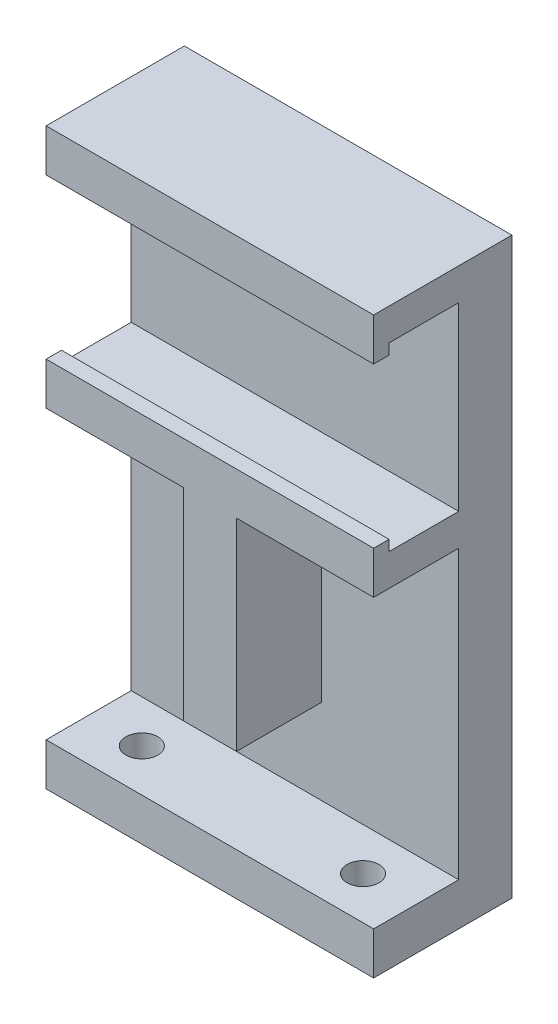
ISO-10303-21;
HEADER;
FILE_DESCRIPTION(('STEP AP214'),'2;1');
FILE_NAME('part.step','',(''),(''),'','','');
FILE_SCHEMA(('AUTOMOTIVE_DESIGN { 1 0 10303 214 1 1 1 1 }'));
ENDSEC;
DATA;
#1=APPLICATION_CONTEXT('core data for automotive mechanical design processes');
#2=APPLICATION_PROTOCOL_DEFINITION('international standard','automotive_design',2000,#1);
#3=PRODUCT_CONTEXT('',#1,'mechanical');
#4=PRODUCT('Part','Part','',(#3));
#5=PRODUCT_RELATED_PRODUCT_CATEGORY('part','',(#4));
#6=PRODUCT_DEFINITION_FORMATION('','',#4);
#7=PRODUCT_DEFINITION_CONTEXT('part definition',#1,'design');
#8=PRODUCT_DEFINITION('design','',#6,#7);
#9=PRODUCT_DEFINITION_SHAPE('','',#8);
#10=(LENGTH_UNIT() NAMED_UNIT(*) SI_UNIT(.MILLI.,.METRE.));
#11=(NAMED_UNIT(*) PLANE_ANGLE_UNIT() SI_UNIT($,.RADIAN.));
#12=(NAMED_UNIT(*) SI_UNIT($,.STERADIAN.) SOLID_ANGLE_UNIT());
#13=UNCERTAINTY_MEASURE_WITH_UNIT(LENGTH_MEASURE(1.E-05),#10,'distance_accuracy_value','');
#14=(GEOMETRIC_REPRESENTATION_CONTEXT(3) GLOBAL_UNCERTAINTY_ASSIGNED_CONTEXT((#13)) GLOBAL_UNIT_ASSIGNED_CONTEXT((#10,
#11,#12)) REPRESENTATION_CONTEXT('',''));
#15=CARTESIAN_POINT('',(0.,0.,0.));
#16=DIRECTION('',(0.,0.,1.));
#17=DIRECTION('',(1.,0.,0.));
#18=AXIS2_PLACEMENT_3D('',#15,#16,#17);
#19=CARTESIAN_POINT('',(0.,42.,5.));
#20=DIRECTION('',(0.,0.,-1.));
#21=DIRECTION('',(-1.,0.,0.));
#22=AXIS2_PLACEMENT_3D('',#19,#20,#21);
#23=PLANE('',#22);
#24=DIRECTION('',(0.,1.,0.));
#25=VECTOR('',#24,1.);
#26=CARTESIAN_POINT('',(17.9,0.,5.));
#27=LINE('',#26,#25);
#28=CARTESIAN_POINT('',(17.9,0.,5.));
#29=VERTEX_POINT('',#28);
#30=CARTESIAN_POINT('',(17.9,19.,5.));
#31=VERTEX_POINT('',#30);
#32=EDGE_CURVE('E307',#29,#31,#27,.T.);
#33=ORIENTED_EDGE('',*,*,#32,.F.);
#34=DIRECTION('',(1.,0.,0.));
#35=VECTOR('',#34,1.);
#36=CARTESIAN_POINT('',(-17.6918060129541,0.,5.));
#37=LINE('',#36,#35);
#38=CARTESIAN_POINT('',(12.9,0.,5.));
#39=VERTEX_POINT('',#38);
#40=EDGE_CURVE('E11',#39,#29,#37,.T.);
#41=ORIENTED_EDGE('',*,*,#40,.F.);
#42=DIRECTION('',(0.,-1.,0.));
#43=VECTOR('',#42,1.);
#44=CARTESIAN_POINT('',(12.9,0.,5.));
#45=LINE('',#44,#43);
#46=CARTESIAN_POINT('',(12.9,19.,5.));
#47=VERTEX_POINT('',#46);
#48=EDGE_CURVE('E285',#47,#39,#45,.T.);
#49=ORIENTED_EDGE('',*,*,#48,.F.);
#50=DIRECTION('',(1.,0.,0.));
#51=VECTOR('',#50,1.);
#52=CARTESIAN_POINT('',(0.,19.,5.));
#53=LINE('',#52,#51);
#54=CARTESIAN_POINT('',(0.,19.,5.));
#55=VERTEX_POINT('',#54);
#56=EDGE_CURVE('E60',#55,#47,#53,.T.);
#57=ORIENTED_EDGE('',*,*,#56,.F.);
#58=DIRECTION('',(0.,-1.,0.));
#59=VECTOR('',#58,1.);
#60=CARTESIAN_POINT('',(0.,0.,5.));
#61=LINE('',#60,#59);
#62=CARTESIAN_POINT('',(0.,-8.,5.));
#63=VERTEX_POINT('',#62);
#64=EDGE_CURVE('E381',#55,#63,#61,.T.);
#65=ORIENTED_EDGE('',*,*,#64,.T.);
#66=DIRECTION('',(1.,0.,0.));
#67=VECTOR('',#66,1.);
#68=CARTESIAN_POINT('',(-17.6918060129541,-8.,5.));
#69=LINE('',#68,#67);
#70=CARTESIAN_POINT('',(30.8,-8.,5.));
#71=VERTEX_POINT('',#70);
#72=EDGE_CURVE('E294',#63,#71,#69,.T.);
#73=ORIENTED_EDGE('',*,*,#72,.T.);
#74=DIRECTION('',(0.,1.,0.));
#75=VECTOR('',#74,1.);
#76=CARTESIAN_POINT('',(30.8,0.,5.));
#77=LINE('',#76,#75);
#78=CARTESIAN_POINT('',(30.8,19.,5.));
#79=VERTEX_POINT('',#78);
#80=EDGE_CURVE('E357',#71,#79,#77,.T.);
#81=ORIENTED_EDGE('',*,*,#80,.T.);
#82=EDGE_CURVE('E326',#31,#79,#53,.T.);
#83=ORIENTED_EDGE('',*,*,#82,.F.);
#84=EDGE_LOOP('',(#33,#41,#49,#57,#65,#73,#81,#83));
#85=FACE_BOUND('',#84,.T.);
#86=ADVANCED_FACE('F34',(#85),#23,.F.);
#87=CARTESIAN_POINT('',(0.,19.,13.));
#88=DIRECTION('',(0.,1.,0.));
#89=DIRECTION('',(0.,0.,1.));
#90=AXIS2_PLACEMENT_3D('',#87,#88,#89);
#91=PLANE('',#90);
#92=DIRECTION('',(0.,0.,-1.));
#93=VECTOR('',#92,1.);
#94=CARTESIAN_POINT('',(12.9,19.,13.));
#95=LINE('',#94,#93);
#96=CARTESIAN_POINT('',(12.9,19.,13.));
#97=VERTEX_POINT('',#96);
#98=EDGE_CURVE('E311',#97,#47,#95,.T.);
#99=ORIENTED_EDGE('',*,*,#98,.F.);
#100=DIRECTION('',(1.,0.,0.));
#101=VECTOR('',#100,1.);
#102=CARTESIAN_POINT('',(0.,19.,13.));
#103=LINE('',#102,#101);
#104=CARTESIAN_POINT('',(0.,19.,13.));
#105=VERTEX_POINT('',#104);
#106=EDGE_CURVE('E319',#105,#97,#103,.T.);
#107=ORIENTED_EDGE('',*,*,#106,.F.);
#108=DIRECTION('',(0.,0.,-1.));
#109=VECTOR('',#108,1.);
#110=CARTESIAN_POINT('',(0.,19.,13.));
#111=LINE('',#110,#109);
#112=EDGE_CURVE('E335',#105,#55,#111,.T.);
#113=ORIENTED_EDGE('',*,*,#112,.T.);
#114=ORIENTED_EDGE('',*,*,#56,.T.);
#115=EDGE_LOOP('',(#99,#107,#113,#114));
#116=FACE_BOUND('',#115,.T.);
#117=ADVANCED_FACE('F464',(#116),#91,.F.);
#118=DIRECTION('',(0.,0.,-1.));
#119=VECTOR('',#118,1.);
#120=CARTESIAN_POINT('',(17.9,19.,13.));
#121=LINE('',#120,#119);
#122=CARTESIAN_POINT('',(17.9,19.,13.));
#123=VERTEX_POINT('',#122);
#124=EDGE_CURVE('E52',#123,#31,#121,.T.);
#125=ORIENTED_EDGE('',*,*,#124,.T.);
#126=ORIENTED_EDGE('',*,*,#82,.T.);
#127=DIRECTION('',(0.,0.,-1.));
#128=VECTOR('',#127,1.);
#129=CARTESIAN_POINT('',(30.8,19.,13.));
#130=LINE('',#129,#128);
#131=CARTESIAN_POINT('',(30.8,19.,13.));
#132=VERTEX_POINT('',#131);
#133=EDGE_CURVE('E332',#132,#79,#130,.T.);
#134=ORIENTED_EDGE('',*,*,#133,.F.);
#135=EDGE_CURVE('E317',#123,#132,#103,.T.);
#136=ORIENTED_EDGE('',*,*,#135,.F.);
#137=EDGE_LOOP('',(#125,#126,#134,#136));
#138=FACE_BOUND('',#137,.T.);
#139=ADVANCED_FACE('F475',(#138),#91,.F.);
#140=DIRECTION('',(-1.,0.,0.));
#141=VECTOR('',#140,1.);
#142=CARTESIAN_POINT('',(0.,22.,5.));
#143=LINE('',#142,#141);
#144=CARTESIAN_POINT('',(30.8,22.,5.));
#145=VERTEX_POINT('',#144);
#146=CARTESIAN_POINT('',(0.,22.,5.));
#147=VERTEX_POINT('',#146);
#148=EDGE_CURVE('E318',#145,#147,#143,.T.);
#149=ORIENTED_EDGE('',*,*,#148,.F.);
#150=CARTESIAN_POINT('',(30.8,39.,5.));
#151=VERTEX_POINT('',#150);
#152=EDGE_CURVE('E385',#145,#151,#77,.T.);
#153=ORIENTED_EDGE('',*,*,#152,.T.);
#154=DIRECTION('',(1.,0.,0.));
#155=VECTOR('',#154,1.);
#156=CARTESIAN_POINT('',(0.,39.,5.));
#157=LINE('',#156,#155);
#158=CARTESIAN_POINT('',(0.,39.,5.));
#159=VERTEX_POINT('',#158);
#160=EDGE_CURVE('E338',#159,#151,#157,.T.);
#161=ORIENTED_EDGE('',*,*,#160,.F.);
#162=EDGE_CURVE('E383',#159,#147,#61,.T.);
#163=ORIENTED_EDGE('',*,*,#162,.T.);
#164=EDGE_LOOP('',(#149,#153,#161,#163));
#165=FACE_BOUND('',#164,.T.);
#166=ADVANCED_FACE('F405',(#165),#23,.F.);
#167=CARTESIAN_POINT('',(0.,0.,5.));
#168=DIRECTION('',(1.,0.,0.));
#169=DIRECTION('',(0.,0.,-1.));
#170=AXIS2_PLACEMENT_3D('',#167,#168,#169);
#171=PLANE('',#170);
#172=DIRECTION('',(0.,-1.,0.));
#173=VECTOR('',#172,1.);
#174=CARTESIAN_POINT('',(0.,0.,0.));
#175=LINE('',#174,#173);
#176=CARTESIAN_POINT('',(0.,42.,0.));
#177=VERTEX_POINT('',#176);
#178=CARTESIAN_POINT('',(0.,-12.,0.));
#179=VERTEX_POINT('',#178);
#180=EDGE_CURVE('E390',#177,#179,#175,.T.);
#181=ORIENTED_EDGE('',*,*,#180,.T.);
#182=DIRECTION('',(0.,0.,1.));
#183=VECTOR('',#182,1.);
#184=CARTESIAN_POINT('',(0.,-12.,13.));
#185=LINE('',#184,#183);
#186=CARTESIAN_POINT('',(0.,-12.,13.));
#187=VERTEX_POINT('',#186);
#188=EDGE_CURVE('E283',#179,#187,#185,.T.);
#189=ORIENTED_EDGE('',*,*,#188,.T.);
#190=DIRECTION('',(0.,1.,0.));
#191=VECTOR('',#190,1.);
#192=CARTESIAN_POINT('',(0.,-8.,13.));
#193=LINE('',#192,#191);
#194=CARTESIAN_POINT('',(0.,-8.,13.));
#195=VERTEX_POINT('',#194);
#196=EDGE_CURVE('E280',#187,#195,#193,.T.);
#197=ORIENTED_EDGE('',*,*,#196,.T.);
#198=DIRECTION('',(0.,0.,-1.));
#199=VECTOR('',#198,1.);
#200=CARTESIAN_POINT('',(0.,-8.,5.));
#201=LINE('',#200,#199);
#202=EDGE_CURVE('E277',#195,#63,#201,.T.);
#203=ORIENTED_EDGE('',*,*,#202,.T.);
#204=ORIENTED_EDGE('',*,*,#64,.F.);
#205=ORIENTED_EDGE('',*,*,#112,.F.);
#206=DIRECTION('',(0.,-1.,0.));
#207=VECTOR('',#206,1.);
#208=CARTESIAN_POINT('',(0.,22.,13.));
#209=LINE('',#208,#207);
#210=CARTESIAN_POINT('',(0.,22.,13.));
#211=VERTEX_POINT('',#210);
#212=EDGE_CURVE('E315',#211,#105,#209,.T.);
#213=ORIENTED_EDGE('',*,*,#212,.F.);
#214=DIRECTION('',(0.,0.,-1.));
#215=VECTOR('',#214,1.);
#216=CARTESIAN_POINT('',(0.,22.,13.));
#217=LINE('',#216,#215);
#218=CARTESIAN_POINT('',(0.,22.,11.55));
#219=VERTEX_POINT('',#218);
#220=EDGE_CURVE('E199',#211,#219,#217,.T.);
#221=ORIENTED_EDGE('',*,*,#220,.T.);
#222=EDGE_CURVE('E324',#219,#147,#217,.T.);
#223=ORIENTED_EDGE('',*,*,#222,.T.);
#224=ORIENTED_EDGE('',*,*,#162,.F.);
#225=DIRECTION('',(0.,0.,-1.));
#226=VECTOR('',#225,1.);
#227=CARTESIAN_POINT('',(0.,39.,13.));
#228=LINE('',#227,#226);
#229=CARTESIAN_POINT('',(0.,39.,11.55));
#230=VERTEX_POINT('',#229);
#231=EDGE_CURVE('E38',#230,#159,#228,.T.);
#232=ORIENTED_EDGE('',*,*,#231,.F.);
#233=CARTESIAN_POINT('',(0.,39.,13.));
#234=VERTEX_POINT('',#233);
#235=EDGE_CURVE('E361',#234,#230,#228,.T.);
#236=ORIENTED_EDGE('',*,*,#235,.F.);
#237=DIRECTION('',(0.,-1.,0.));
#238=VECTOR('',#237,1.);
#239=CARTESIAN_POINT('',(0.,39.,13.));
#240=LINE('',#239,#238);
#241=CARTESIAN_POINT('',(0.,42.,13.));
#242=VERTEX_POINT('',#241);
#243=EDGE_CURVE('E345',#242,#234,#240,.T.);
#244=ORIENTED_EDGE('',*,*,#243,.F.);
#245=DIRECTION('',(0.,0.,-1.));
#246=VECTOR('',#245,1.);
#247=CARTESIAN_POINT('',(0.,42.,5.));
#248=LINE('',#247,#246);
#249=EDGE_CURVE('E396',#242,#177,#248,.T.);
#250=ORIENTED_EDGE('',*,*,#249,.T.);
#251=EDGE_LOOP('',(#181,#189,#197,#203,#204,#205,#213,#221,#223,#224,#232,#236,#244,#250));
#252=FACE_BOUND('',#251,.T.);
#253=ADVANCED_FACE('F36',(#252),#171,.F.);
#254=CARTESIAN_POINT('',(0.,0.,5.));
#255=DIRECTION('',(0.,1.,0.));
#256=DIRECTION('',(0.,0.,1.));
#257=AXIS2_PLACEMENT_3D('',#254,#255,#256);
#258=PLANE('',#257);
#259=DIRECTION('',(0.,0.,-1.));
#260=VECTOR('',#259,1.);
#261=CARTESIAN_POINT('',(12.9,0.,13.));
#262=LINE('',#261,#260);
#263=CARTESIAN_POINT('',(12.9,0.,13.));
#264=VERTEX_POINT('',#263);
#265=EDGE_CURVE('E369',#264,#39,#262,.T.);
#266=ORIENTED_EDGE('',*,*,#265,.T.);
#267=ORIENTED_EDGE('',*,*,#40,.T.);
#268=DIRECTION('',(0.,0.,-1.));
#269=VECTOR('',#268,1.);
#270=CARTESIAN_POINT('',(17.9,0.,13.));
#271=LINE('',#270,#269);
#272=CARTESIAN_POINT('',(17.9,0.,13.));
#273=VERTEX_POINT('',#272);
#274=EDGE_CURVE('E314',#273,#29,#271,.T.);
#275=ORIENTED_EDGE('',*,*,#274,.F.);
#276=DIRECTION('',(1.,0.,0.));
#277=VECTOR('',#276,1.);
#278=CARTESIAN_POINT('',(12.9,0.,13.));
#279=LINE('',#278,#277);
#280=EDGE_CURVE('E306',#264,#273,#279,.T.);
#281=ORIENTED_EDGE('',*,*,#280,.F.);
#282=EDGE_LOOP('',(#266,#267,#275,#281));
#283=FACE_BOUND('',#282,.T.);
#284=ADVANCED_FACE('F470',(#283),#258,.F.);
#285=CARTESIAN_POINT('',(30.8,0.,5.));
#286=DIRECTION('',(-1.,0.,0.));
#287=DIRECTION('',(0.,0.,1.));
#288=AXIS2_PLACEMENT_3D('',#285,#286,#287);
#289=PLANE('',#288);
#290=DIRECTION('',(0.,1.,0.));
#291=VECTOR('',#290,1.);
#292=CARTESIAN_POINT('',(30.8,0.,0.));
#293=LINE('',#292,#291);
#294=CARTESIAN_POINT('',(30.8,-12.,0.));
#295=VERTEX_POINT('',#294);
#296=CARTESIAN_POINT('',(30.8,42.,0.));
#297=VERTEX_POINT('',#296);
#298=EDGE_CURVE('E393',#295,#297,#293,.T.);
#299=ORIENTED_EDGE('',*,*,#298,.T.);
#300=DIRECTION('',(0.,0.,-1.));
#301=VECTOR('',#300,1.);
#302=CARTESIAN_POINT('',(30.8,42.,5.));
#303=LINE('',#302,#301);
#304=CARTESIAN_POINT('',(30.8,42.,13.));
#305=VERTEX_POINT('',#304);
#306=EDGE_CURVE('E44',#305,#297,#303,.T.);
#307=ORIENTED_EDGE('',*,*,#306,.F.);
#308=DIRECTION('',(0.,1.,0.));
#309=VECTOR('',#308,1.);
#310=CARTESIAN_POINT('',(30.8,42.,13.));
#311=LINE('',#310,#309);
#312=CARTESIAN_POINT('',(30.8,38.,13.));
#313=VERTEX_POINT('',#312);
#314=EDGE_CURVE('E339',#313,#305,#311,.T.);
#315=ORIENTED_EDGE('',*,*,#314,.F.);
#316=DIRECTION('',(0.,0.,-1.));
#317=VECTOR('',#316,1.);
#318=CARTESIAN_POINT('',(30.8,38.,13.));
#319=LINE('',#318,#317);
#320=CARTESIAN_POINT('',(30.8,38.,11.55));
#321=VERTEX_POINT('',#320);
#322=EDGE_CURVE('E231',#313,#321,#319,.T.);
#323=ORIENTED_EDGE('',*,*,#322,.T.);
#324=DIRECTION('',(0.,1.,0.));
#325=VECTOR('',#324,1.);
#326=CARTESIAN_POINT('',(30.8,39.,11.55));
#327=LINE('',#326,#325);
#328=CARTESIAN_POINT('',(30.8,39.,11.55));
#329=VERTEX_POINT('',#328);
#330=EDGE_CURVE('E240',#321,#329,#327,.T.);
#331=ORIENTED_EDGE('',*,*,#330,.T.);
#332=DIRECTION('',(0.,0.,-1.));
#333=VECTOR('',#332,1.);
#334=CARTESIAN_POINT('',(30.8,39.,13.));
#335=LINE('',#334,#333);
#336=EDGE_CURVE('E348',#329,#151,#335,.T.);
#337=ORIENTED_EDGE('',*,*,#336,.T.);
#338=ORIENTED_EDGE('',*,*,#152,.F.);
#339=DIRECTION('',(0.,0.,-1.));
#340=VECTOR('',#339,1.);
#341=CARTESIAN_POINT('',(30.8,22.,13.));
#342=LINE('',#341,#340);
#343=CARTESIAN_POINT('',(30.8,22.,11.55));
#344=VERTEX_POINT('',#343);
#345=EDGE_CURVE('E330',#344,#145,#342,.T.);
#346=ORIENTED_EDGE('',*,*,#345,.F.);
#347=DIRECTION('',(0.,1.,0.));
#348=VECTOR('',#347,1.);
#349=CARTESIAN_POINT('',(30.8,22.,11.55));
#350=LINE('',#349,#348);
#351=CARTESIAN_POINT('',(30.8,23.,11.55));
#352=VERTEX_POINT('',#351);
#353=EDGE_CURVE('E223',#344,#352,#350,.T.);
#354=ORIENTED_EDGE('',*,*,#353,.T.);
#355=DIRECTION('',(0.,0.,1.));
#356=VECTOR('',#355,1.);
#357=CARTESIAN_POINT('',(30.8,23.,13.));
#358=LINE('',#357,#356);
#359=CARTESIAN_POINT('',(30.8,23.,13.));
#360=VERTEX_POINT('',#359);
#361=EDGE_CURVE('E220',#352,#360,#358,.T.);
#362=ORIENTED_EDGE('',*,*,#361,.T.);
#363=DIRECTION('',(0.,1.,0.));
#364=VECTOR('',#363,1.);
#365=CARTESIAN_POINT('',(30.8,22.,13.));
#366=LINE('',#365,#364);
#367=EDGE_CURVE('E322',#132,#360,#366,.T.);
#368=ORIENTED_EDGE('',*,*,#367,.F.);
#369=ORIENTED_EDGE('',*,*,#133,.T.);
#370=ORIENTED_EDGE('',*,*,#80,.F.);
#371=DIRECTION('',(0.,0.,1.));
#372=VECTOR('',#371,1.);
#373=CARTESIAN_POINT('',(30.8,-8.,5.));
#374=LINE('',#373,#372);
#375=CARTESIAN_POINT('',(30.8,-8.,13.));
#376=VERTEX_POINT('',#375);
#377=EDGE_CURVE('E274',#71,#376,#374,.T.);
#378=ORIENTED_EDGE('',*,*,#377,.T.);
#379=DIRECTION('',(0.,-1.,0.));
#380=VECTOR('',#379,1.);
#381=CARTESIAN_POINT('',(30.8,-8.,13.));
#382=LINE('',#381,#380);
#383=CARTESIAN_POINT('',(30.8,-12.,13.));
#384=VERTEX_POINT('',#383);
#385=EDGE_CURVE('E288',#376,#384,#382,.T.);
#386=ORIENTED_EDGE('',*,*,#385,.T.);
#387=DIRECTION('',(0.,0.,-1.));
#388=VECTOR('',#387,1.);
#389=CARTESIAN_POINT('',(30.8,-12.,13.));
#390=LINE('',#389,#388);
#391=EDGE_CURVE('E291',#384,#295,#390,.T.);
#392=ORIENTED_EDGE('',*,*,#391,.T.);
#393=EDGE_LOOP('',(#299,#307,#315,#323,#331,#337,#338,#346,#354,#362,#368,#369,#370,#378,#386,#392));
#394=FACE_BOUND('',#393,.T.);
#395=ADVANCED_FACE('F415',(#394),#289,.F.);
#396=CARTESIAN_POINT('',(0.,42.,5.));
#397=DIRECTION('',(0.,-1.,0.));
#398=DIRECTION('',(0.,0.,-1.));
#399=AXIS2_PLACEMENT_3D('',#396,#397,#398);
#400=PLANE('',#399);
#401=DIRECTION('',(-1.,0.,0.));
#402=VECTOR('',#401,1.);
#403=CARTESIAN_POINT('',(0.,42.,0.));
#404=LINE('',#403,#402);
#405=EDGE_CURVE('E384',#297,#177,#404,.T.);
#406=ORIENTED_EDGE('',*,*,#405,.T.);
#407=ORIENTED_EDGE('',*,*,#249,.F.);
#408=DIRECTION('',(-1.,0.,0.));
#409=VECTOR('',#408,1.);
#410=CARTESIAN_POINT('',(0.,42.,13.));
#411=LINE('',#410,#409);
#412=EDGE_CURVE('E342',#305,#242,#411,.T.);
#413=ORIENTED_EDGE('',*,*,#412,.F.);
#414=ORIENTED_EDGE('',*,*,#306,.T.);
#415=EDGE_LOOP('',(#406,#407,#413,#414));
#416=FACE_BOUND('',#415,.T.);
#417=ADVANCED_FACE('F514',(#416),#400,.F.);
#418=CARTESIAN_POINT('',(0.,42.,0.));
#419=DIRECTION('',(0.,0.,-1.));
#420=DIRECTION('',(-1.,0.,0.));
#421=AXIS2_PLACEMENT_3D('',#418,#419,#420);
#422=PLANE('',#421);
#423=ORIENTED_EDGE('',*,*,#180,.F.);
#424=ORIENTED_EDGE('',*,*,#405,.F.);
#425=ORIENTED_EDGE('',*,*,#298,.F.);
#426=DIRECTION('',(1.,0.,0.));
#427=VECTOR('',#426,1.);
#428=CARTESIAN_POINT('',(-17.6918060129541,-12.,0.));
#429=LINE('',#428,#427);
#430=EDGE_CURVE('E281',#179,#295,#429,.T.);
#431=ORIENTED_EDGE('',*,*,#430,.F.);
#432=EDGE_LOOP('',(#423,#424,#425,#431));
#433=FACE_BOUND('',#432,.T.);
#434=ADVANCED_FACE('F443',(#433),#422,.T.);
#435=CARTESIAN_POINT('',(0.,39.,13.));
#436=DIRECTION('',(0.,1.,0.));
#437=DIRECTION('',(0.,0.,1.));
#438=AXIS2_PLACEMENT_3D('',#435,#436,#437);
#439=PLANE('',#438);
#440=ORIENTED_EDGE('',*,*,#336,.F.);
#441=DIRECTION('',(1.,0.,0.));
#442=VECTOR('',#441,1.);
#443=CARTESIAN_POINT('',(-5.00000000014378E-05,39.,11.55));
#444=LINE('',#443,#442);
#445=EDGE_CURVE('E260',#230,#329,#444,.T.);
#446=ORIENTED_EDGE('',*,*,#445,.F.);
#447=ORIENTED_EDGE('',*,*,#231,.T.);
#448=ORIENTED_EDGE('',*,*,#160,.T.);
#449=EDGE_LOOP('',(#440,#446,#447,#448));
#450=FACE_BOUND('',#449,.T.);
#451=ADVANCED_FACE('F418',(#450),#439,.F.);
#452=CARTESIAN_POINT('',(30.8,39.,13.));
#453=DIRECTION('',(0.,0.,1.));
#454=DIRECTION('',(1.,0.,0.));
#455=AXIS2_PLACEMENT_3D('',#452,#453,#454);
#456=PLANE('',#455);
#457=ORIENTED_EDGE('',*,*,#314,.T.);
#458=ORIENTED_EDGE('',*,*,#412,.T.);
#459=ORIENTED_EDGE('',*,*,#243,.T.);
#460=DIRECTION('',(1.,0.,0.));
#461=VECTOR('',#460,1.);
#462=CARTESIAN_POINT('',(-5.00000000014378E-05,39.,13.));
#463=LINE('',#462,#461);
#464=CARTESIAN_POINT('',(-5.00000000014378E-05,39.,13.));
#465=VERTEX_POINT('',#464);
#466=EDGE_CURVE('E254',#465,#234,#463,.T.);
#467=ORIENTED_EDGE('',*,*,#466,.F.);
#468=DIRECTION('',(0.,-1.,0.));
#469=VECTOR('',#468,1.);
#470=CARTESIAN_POINT('',(-5.00000000014378E-05,39.,13.));
#471=LINE('',#470,#469);
#472=CARTESIAN_POINT('',(-5.00000000014378E-05,38.,13.));
#473=VERTEX_POINT('',#472);
#474=EDGE_CURVE('E236',#465,#473,#471,.T.);
#475=ORIENTED_EDGE('',*,*,#474,.T.);
#476=DIRECTION('',(1.,0.,0.));
#477=VECTOR('',#476,1.);
#478=CARTESIAN_POINT('',(-5.00000000014378E-05,38.,13.));
#479=LINE('',#478,#477);
#480=EDGE_CURVE('E249',#473,#313,#479,.T.);
#481=ORIENTED_EDGE('',*,*,#480,.T.);
#482=EDGE_LOOP('',(#457,#458,#459,#467,#475,#481));
#483=FACE_BOUND('',#482,.T.);
#484=ADVANCED_FACE('F434',(#483),#456,.T.);
#485=CARTESIAN_POINT('',(0.,22.,13.));
#486=DIRECTION('',(0.,-1.,0.));
#487=DIRECTION('',(0.,0.,-1.));
#488=AXIS2_PLACEMENT_3D('',#485,#486,#487);
#489=PLANE('',#488);
#490=ORIENTED_EDGE('',*,*,#222,.F.);
#491=DIRECTION('',(1.,0.,0.));
#492=VECTOR('',#491,1.);
#493=CARTESIAN_POINT('',(-5.00000000014378E-05,22.,11.55));
#494=LINE('',#493,#492);
#495=EDGE_CURVE('E204',#219,#344,#494,.T.);
#496=ORIENTED_EDGE('',*,*,#495,.T.);
#497=ORIENTED_EDGE('',*,*,#345,.T.);
#498=ORIENTED_EDGE('',*,*,#148,.T.);
#499=EDGE_LOOP('',(#490,#496,#497,#498));
#500=FACE_BOUND('',#499,.T.);
#501=ADVANCED_FACE('F410',(#500),#489,.F.);
#502=CARTESIAN_POINT('',(0.,19.,13.));
#503=DIRECTION('',(0.,0.,1.));
#504=DIRECTION('',(1.,0.,0.));
#505=AXIS2_PLACEMENT_3D('',#502,#503,#504);
#506=PLANE('',#505);
#507=ORIENTED_EDGE('',*,*,#212,.T.);
#508=ORIENTED_EDGE('',*,*,#106,.T.);
#509=DIRECTION('',(0.,-1.,0.));
#510=VECTOR('',#509,1.);
#511=CARTESIAN_POINT('',(12.9,0.,13.));
#512=LINE('',#511,#510);
#513=EDGE_CURVE('E303',#97,#264,#512,.T.);
#514=ORIENTED_EDGE('',*,*,#513,.T.);
#515=ORIENTED_EDGE('',*,*,#280,.T.);
#516=DIRECTION('',(0.,1.,0.));
#517=VECTOR('',#516,1.);
#518=CARTESIAN_POINT('',(17.9,0.,13.));
#519=LINE('',#518,#517);
#520=EDGE_CURVE('E309',#273,#123,#519,.T.);
#521=ORIENTED_EDGE('',*,*,#520,.T.);
#522=ORIENTED_EDGE('',*,*,#135,.T.);
#523=ORIENTED_EDGE('',*,*,#367,.T.);
#524=DIRECTION('',(1.,0.,0.));
#525=VECTOR('',#524,1.);
#526=CARTESIAN_POINT('',(-5.00000000014378E-05,23.,13.));
#527=LINE('',#526,#525);
#528=CARTESIAN_POINT('',(-5.00000000014378E-05,23.,13.));
#529=VERTEX_POINT('',#528);
#530=EDGE_CURVE('E219',#529,#360,#527,.T.);
#531=ORIENTED_EDGE('',*,*,#530,.F.);
#532=DIRECTION('',(0.,-1.,0.));
#533=VECTOR('',#532,1.);
#534=CARTESIAN_POINT('',(-5.00000000014378E-05,22.,13.));
#535=LINE('',#534,#533);
#536=CARTESIAN_POINT('',(-5.00000000014378E-05,22.,13.));
#537=VERTEX_POINT('',#536);
#538=EDGE_CURVE('E212',#529,#537,#535,.T.);
#539=ORIENTED_EDGE('',*,*,#538,.T.);
#540=DIRECTION('',(1.,0.,0.));
#541=VECTOR('',#540,1.);
#542=CARTESIAN_POINT('',(-5.00000000014378E-05,22.,13.));
#543=LINE('',#542,#541);
#544=EDGE_CURVE('E193',#537,#211,#543,.T.);
#545=ORIENTED_EDGE('',*,*,#544,.T.);
#546=EDGE_LOOP('',(#507,#508,#514,#515,#521,#522,#523,#531,#539,#545));
#547=FACE_BOUND('',#546,.T.);
#548=ADVANCED_FACE('F217',(#547),#506,.T.);
#549=CARTESIAN_POINT('',(12.9,0.,13.));
#550=DIRECTION('',(1.,0.,0.));
#551=DIRECTION('',(0.,0.,-1.));
#552=AXIS2_PLACEMENT_3D('',#549,#550,#551);
#553=PLANE('',#552);
#554=ORIENTED_EDGE('',*,*,#48,.T.);
#555=ORIENTED_EDGE('',*,*,#265,.F.);
#556=ORIENTED_EDGE('',*,*,#513,.F.);
#557=ORIENTED_EDGE('',*,*,#98,.T.);
#558=EDGE_LOOP('',(#554,#555,#556,#557));
#559=FACE_BOUND('',#558,.T.);
#560=ADVANCED_FACE('F468',(#559),#553,.F.);
#561=CARTESIAN_POINT('',(17.9,0.,13.));
#562=DIRECTION('',(-1.,0.,0.));
#563=DIRECTION('',(0.,0.,1.));
#564=AXIS2_PLACEMENT_3D('',#561,#562,#563);
#565=PLANE('',#564);
#566=ORIENTED_EDGE('',*,*,#32,.T.);
#567=ORIENTED_EDGE('',*,*,#124,.F.);
#568=ORIENTED_EDGE('',*,*,#520,.F.);
#569=ORIENTED_EDGE('',*,*,#274,.T.);
#570=EDGE_LOOP('',(#566,#567,#568,#569));
#571=FACE_BOUND('',#570,.T.);
#572=ADVANCED_FACE('F471',(#571),#565,.F.);
#573=CARTESIAN_POINT('',(-17.6918060129541,-12.,13.));
#574=DIRECTION('',(0.,-1.,0.));
#575=DIRECTION('',(0.,0.,-1.));
#576=AXIS2_PLACEMENT_3D('',#573,#574,#575);
#577=PLANE('',#576);
#578=CARTESIAN_POINT('',(25.8,-12.,9.));
#579=DIRECTION('',(0.,-1.,0.));
#580=DIRECTION('',(0.,0.,-1.));
#581=AXIS2_PLACEMENT_3D('',#578,#579,#580);
#582=CIRCLE('',#581,1.5);
#583=CARTESIAN_POINT('',(25.8,-12.,7.5));
#584=VERTEX_POINT('',#583);
#585=EDGE_CURVE('E256',#584,#584,#582,.F.);
#586=ORIENTED_EDGE('',*,*,#585,.T.);
#587=EDGE_LOOP('',(#586));
#588=FACE_BOUND('',#587,.T.);
#589=CARTESIAN_POINT('',(5.,-12.,9.));
#590=DIRECTION('',(0.,-1.,0.));
#591=DIRECTION('',(0.,0.,-1.));
#592=AXIS2_PLACEMENT_3D('',#589,#590,#591);
#593=CIRCLE('',#592,1.5);
#594=CARTESIAN_POINT('',(5.,-12.,7.5));
#595=VERTEX_POINT('',#594);
#596=EDGE_CURVE('E268',#595,#595,#593,.F.);
#597=ORIENTED_EDGE('',*,*,#596,.T.);
#598=EDGE_LOOP('',(#597));
#599=FACE_BOUND('',#598,.T.);
#600=ORIENTED_EDGE('',*,*,#188,.F.);
#601=ORIENTED_EDGE('',*,*,#430,.T.);
#602=ORIENTED_EDGE('',*,*,#391,.F.);
#603=DIRECTION('',(1.,0.,0.));
#604=VECTOR('',#603,1.);
#605=CARTESIAN_POINT('',(-17.6918060129541,-12.,13.));
#606=LINE('',#605,#604);
#607=EDGE_CURVE('E297',#187,#384,#606,.T.);
#608=ORIENTED_EDGE('',*,*,#607,.F.);
#609=EDGE_LOOP('',(#600,#601,#602,#608));
#610=FACE_BOUND('',#609,.T.);
#611=ADVANCED_FACE('F446',(#588,#599,#610),#577,.T.);
#612=CARTESIAN_POINT('',(-17.6918060129541,-8.,13.));
#613=DIRECTION('',(0.,0.,1.));
#614=DIRECTION('',(0.,-1.,0.));
#615=AXIS2_PLACEMENT_3D('',#612,#613,#614);
#616=PLANE('',#615);
#617=ORIENTED_EDGE('',*,*,#196,.F.);
#618=ORIENTED_EDGE('',*,*,#607,.T.);
#619=ORIENTED_EDGE('',*,*,#385,.F.);
#620=DIRECTION('',(1.,0.,0.));
#621=VECTOR('',#620,1.);
#622=CARTESIAN_POINT('',(-17.6918060129541,-8.,13.));
#623=LINE('',#622,#621);
#624=EDGE_CURVE('E299',#195,#376,#623,.T.);
#625=ORIENTED_EDGE('',*,*,#624,.F.);
#626=EDGE_LOOP('',(#617,#618,#619,#625));
#627=FACE_BOUND('',#626,.T.);
#628=ADVANCED_FACE('F453',(#627),#616,.T.);
#629=CARTESIAN_POINT('',(-17.6918060129541,-8.,5.));
#630=DIRECTION('',(0.,1.,0.));
#631=DIRECTION('',(0.,0.,1.));
#632=AXIS2_PLACEMENT_3D('',#629,#630,#631);
#633=PLANE('',#632);
#634=CARTESIAN_POINT('',(25.8,-8.,9.));
#635=DIRECTION('',(0.,1.,0.));
#636=DIRECTION('',(0.,0.,1.));
#637=AXIS2_PLACEMENT_3D('',#634,#635,#636);
#638=CIRCLE('',#637,1.5);
#639=CARTESIAN_POINT('',(25.8,-8.,10.5));
#640=VERTEX_POINT('',#639);
#641=EDGE_CURVE('E265',#640,#640,#638,.T.);
#642=ORIENTED_EDGE('',*,*,#641,.F.);
#643=EDGE_LOOP('',(#642));
#644=FACE_BOUND('',#643,.T.);
#645=CARTESIAN_POINT('',(5.,-8.,9.));
#646=DIRECTION('',(0.,1.,0.));
#647=DIRECTION('',(0.,0.,1.));
#648=AXIS2_PLACEMENT_3D('',#645,#646,#647);
#649=CIRCLE('',#648,1.5);
#650=CARTESIAN_POINT('',(5.,-8.,10.5));
#651=VERTEX_POINT('',#650);
#652=EDGE_CURVE('E271',#651,#651,#649,.T.);
#653=ORIENTED_EDGE('',*,*,#652,.F.);
#654=EDGE_LOOP('',(#653));
#655=FACE_BOUND('',#654,.T.);
#656=ORIENTED_EDGE('',*,*,#202,.F.);
#657=ORIENTED_EDGE('',*,*,#624,.T.);
#658=ORIENTED_EDGE('',*,*,#377,.F.);
#659=ORIENTED_EDGE('',*,*,#72,.F.);
#660=EDGE_LOOP('',(#656,#657,#658,#659));
#661=FACE_BOUND('',#660,.T.);
#662=ADVANCED_FACE('F457',(#644,#655,#661),#633,.T.);
#663=CARTESIAN_POINT('',(5.,-12.001,9.));
#664=DIRECTION('',(0.,1.,0.));
#665=DIRECTION('',(0.,0.,1.));
#666=AXIS2_PLACEMENT_3D('',#663,#664,#665);
#667=CYLINDRICAL_SURFACE('',#666,1.5);
#668=ORIENTED_EDGE('',*,*,#596,.F.);
#669=EDGE_LOOP('',(#668));
#670=FACE_BOUND('',#669,.T.);
#671=ORIENTED_EDGE('',*,*,#652,.T.);
#672=EDGE_LOOP('',(#671));
#673=FACE_BOUND('',#672,.T.);
#674=ADVANCED_FACE('F616',(#670,#673),#667,.F.);
#675=CARTESIAN_POINT('',(25.8,-12.001,9.));
#676=DIRECTION('',(0.,1.,0.));
#677=DIRECTION('',(0.,0.,1.));
#678=AXIS2_PLACEMENT_3D('',#675,#676,#677);
#679=CYLINDRICAL_SURFACE('',#678,1.5);
#680=ORIENTED_EDGE('',*,*,#585,.F.);
#681=EDGE_LOOP('',(#680));
#682=FACE_BOUND('',#681,.T.);
#683=ORIENTED_EDGE('',*,*,#641,.T.);
#684=EDGE_LOOP('',(#683));
#685=FACE_BOUND('',#684,.T.);
#686=ADVANCED_FACE('F624',(#682,#685),#679,.F.);
#687=CARTESIAN_POINT('',(-5.00000000014378E-05,39.,13.));
#688=DIRECTION('',(0.,1.,0.));
#689=DIRECTION('',(0.,0.,1.));
#690=AXIS2_PLACEMENT_3D('',#687,#688,#689);
#691=PLANE('',#690);
#692=ORIENTED_EDGE('',*,*,#235,.T.);
#693=CARTESIAN_POINT('',(-5.00000000014378E-05,39.,11.55));
#694=VERTEX_POINT('',#693);
#695=EDGE_CURVE('E257',#694,#230,#444,.T.);
#696=ORIENTED_EDGE('',*,*,#695,.F.);
#697=DIRECTION('',(0.,0.,1.));
#698=VECTOR('',#697,1.);
#699=CARTESIAN_POINT('',(-5.00000000014378E-05,39.,13.));
#700=LINE('',#699,#698);
#701=EDGE_CURVE('E246',#694,#465,#700,.T.);
#702=ORIENTED_EDGE('',*,*,#701,.T.);
#703=ORIENTED_EDGE('',*,*,#466,.T.);
#704=EDGE_LOOP('',(#692,#696,#702,#703));
#705=FACE_BOUND('',#704,.T.);
#706=ADVANCED_FACE('F422',(#705),#691,.T.);
#707=CARTESIAN_POINT('',(-5.00000000014378E-05,39.,11.55));
#708=DIRECTION('',(0.,0.,-1.));
#709=DIRECTION('',(-1.,0.,0.));
#710=AXIS2_PLACEMENT_3D('',#707,#708,#709);
#711=PLANE('',#710);
#712=ORIENTED_EDGE('',*,*,#330,.F.);
#713=DIRECTION('',(1.,0.,0.));
#714=VECTOR('',#713,1.);
#715=CARTESIAN_POINT('',(-5.00000000014378E-05,38.,11.55));
#716=LINE('',#715,#714);
#717=CARTESIAN_POINT('',(-5.00000000014378E-05,38.,11.55));
#718=VERTEX_POINT('',#717);
#719=EDGE_CURVE('E261',#718,#321,#716,.T.);
#720=ORIENTED_EDGE('',*,*,#719,.F.);
#721=DIRECTION('',(0.,1.,0.));
#722=VECTOR('',#721,1.);
#723=CARTESIAN_POINT('',(-5.00000000014378E-05,39.,11.55));
#724=LINE('',#723,#722);
#725=EDGE_CURVE('E243',#718,#694,#724,.T.);
#726=ORIENTED_EDGE('',*,*,#725,.T.);
#727=ORIENTED_EDGE('',*,*,#695,.T.);
#728=ORIENTED_EDGE('',*,*,#445,.T.);
#729=EDGE_LOOP('',(#712,#720,#726,#727,#728));
#730=FACE_BOUND('',#729,.T.);
#731=ADVANCED_FACE('F426',(#730),#711,.T.);
#732=CARTESIAN_POINT('',(-5.00000000014378E-05,38.,13.));
#733=DIRECTION('',(0.,-1.,0.));
#734=DIRECTION('',(0.,0.,-1.));
#735=AXIS2_PLACEMENT_3D('',#732,#733,#734);
#736=PLANE('',#735);
#737=ORIENTED_EDGE('',*,*,#322,.F.);
#738=ORIENTED_EDGE('',*,*,#480,.F.);
#739=DIRECTION('',(0.,0.,-1.));
#740=VECTOR('',#739,1.);
#741=CARTESIAN_POINT('',(-5.00000000014378E-05,38.,13.));
#742=LINE('',#741,#740);
#743=EDGE_CURVE('E239',#473,#718,#742,.T.);
#744=ORIENTED_EDGE('',*,*,#743,.T.);
#745=ORIENTED_EDGE('',*,*,#719,.T.);
#746=EDGE_LOOP('',(#737,#738,#744,#745));
#747=FACE_BOUND('',#746,.T.);
#748=ADVANCED_FACE('F647',(#747),#736,.T.);
#749=CARTESIAN_POINT('',(-5.00000000014378E-05,38.,13.));
#750=DIRECTION('',(1.,0.,0.));
#751=DIRECTION('',(0.,0.,-1.));
#752=AXIS2_PLACEMENT_3D('',#749,#750,#751);
#753=PLANE('',#752);
#754=ORIENTED_EDGE('',*,*,#474,.F.);
#755=ORIENTED_EDGE('',*,*,#701,.F.);
#756=ORIENTED_EDGE('',*,*,#725,.F.);
#757=ORIENTED_EDGE('',*,*,#743,.F.);
#758=EDGE_LOOP('',(#754,#755,#756,#757));
#759=FACE_BOUND('',#758,.T.);
#760=ADVANCED_FACE('F432',(#759),#753,.F.);
#761=CARTESIAN_POINT('',(-5.00000000014378E-05,22.,13.));
#762=DIRECTION('',(0.,-1.,0.));
#763=DIRECTION('',(0.,0.,-1.));
#764=AXIS2_PLACEMENT_3D('',#761,#762,#763);
#765=PLANE('',#764);
#766=ORIENTED_EDGE('',*,*,#220,.F.);
#767=ORIENTED_EDGE('',*,*,#544,.F.);
#768=DIRECTION('',(0.,0.,-1.));
#769=VECTOR('',#768,1.);
#770=CARTESIAN_POINT('',(-5.00000000014378E-05,22.,13.));
#771=LINE('',#770,#769);
#772=CARTESIAN_POINT('',(-5.00000000014378E-05,22.,11.55));
#773=VERTEX_POINT('',#772);
#774=EDGE_CURVE('E197',#537,#773,#771,.T.);
#775=ORIENTED_EDGE('',*,*,#774,.T.);
#776=EDGE_CURVE('E234',#773,#219,#494,.T.);
#777=ORIENTED_EDGE('',*,*,#776,.T.);
#778=EDGE_LOOP('',(#766,#767,#775,#777));
#779=FACE_BOUND('',#778,.T.);
#780=ADVANCED_FACE('F195',(#779),#765,.T.);
#781=CARTESIAN_POINT('',(-5.00000000014378E-05,23.,13.));
#782=DIRECTION('',(0.,1.,0.));
#783=DIRECTION('',(0.,0.,1.));
#784=AXIS2_PLACEMENT_3D('',#781,#782,#783);
#785=PLANE('',#784);
#786=ORIENTED_EDGE('',*,*,#361,.F.);
#787=DIRECTION('',(1.,0.,0.));
#788=VECTOR('',#787,1.);
#789=CARTESIAN_POINT('',(-5.00000000014378E-05,23.,11.55));
#790=LINE('',#789,#788);
#791=CARTESIAN_POINT('',(-5.00000000014378E-05,23.,11.55));
#792=VERTEX_POINT('',#791);
#793=EDGE_CURVE('E232',#792,#352,#790,.T.);
#794=ORIENTED_EDGE('',*,*,#793,.F.);
#795=DIRECTION('',(0.,0.,1.));
#796=VECTOR('',#795,1.);
#797=CARTESIAN_POINT('',(-5.00000000014378E-05,23.,13.));
#798=LINE('',#797,#796);
#799=EDGE_CURVE('E205',#792,#529,#798,.T.);
#800=ORIENTED_EDGE('',*,*,#799,.T.);
#801=ORIENTED_EDGE('',*,*,#530,.T.);
#802=EDGE_LOOP('',(#786,#794,#800,#801));
#803=FACE_BOUND('',#802,.T.);
#804=ADVANCED_FACE('F479',(#803),#785,.T.);
#805=CARTESIAN_POINT('',(-5.00000000014378E-05,22.,11.55));
#806=DIRECTION('',(0.,0.,-1.));
#807=DIRECTION('',(-1.,0.,0.));
#808=AXIS2_PLACEMENT_3D('',#805,#806,#807);
#809=PLANE('',#808);
#810=ORIENTED_EDGE('',*,*,#353,.F.);
#811=ORIENTED_EDGE('',*,*,#495,.F.);
#812=ORIENTED_EDGE('',*,*,#776,.F.);
#813=DIRECTION('',(0.,1.,0.));
#814=VECTOR('',#813,1.);
#815=CARTESIAN_POINT('',(-5.00000000014378E-05,22.,11.55));
#816=LINE('',#815,#814);
#817=EDGE_CURVE('E215',#773,#792,#816,.T.);
#818=ORIENTED_EDGE('',*,*,#817,.T.);
#819=ORIENTED_EDGE('',*,*,#793,.T.);
#820=EDGE_LOOP('',(#810,#811,#812,#818,#819));
#821=FACE_BOUND('',#820,.T.);
#822=ADVANCED_FACE('F481',(#821),#809,.T.);
#823=CARTESIAN_POINT('',(-5.00000000014378E-05,23.,13.));
#824=DIRECTION('',(-1.,0.,0.));
#825=DIRECTION('',(0.,0.,1.));
#826=AXIS2_PLACEMENT_3D('',#823,#824,#825);
#827=PLANE('',#826);
#828=ORIENTED_EDGE('',*,*,#538,.F.);
#829=ORIENTED_EDGE('',*,*,#799,.F.);
#830=ORIENTED_EDGE('',*,*,#817,.F.);
#831=ORIENTED_EDGE('',*,*,#774,.F.);
#832=EDGE_LOOP('',(#828,#829,#830,#831));
#833=FACE_BOUND('',#832,.T.);
#834=ADVANCED_FACE('F210',(#833),#827,.T.);
#835=CLOSED_SHELL('',(#86,#117,#139,#166,#253,#284,#395,#417,#434,#451,#484,#501,#548,#560,#572,
#611,#628,#662,#674,#686,#706,#731,#748,#760,#780,#804,#822,#834));
#836=MANIFOLD_SOLID_BREP('B2',#835);
#837=ADVANCED_BREP_SHAPE_REPRESENTATION('',(#18,#836),#14);
#838=SHAPE_DEFINITION_REPRESENTATION(#9,#837);
ENDSEC;
END-ISO-10303-21;
